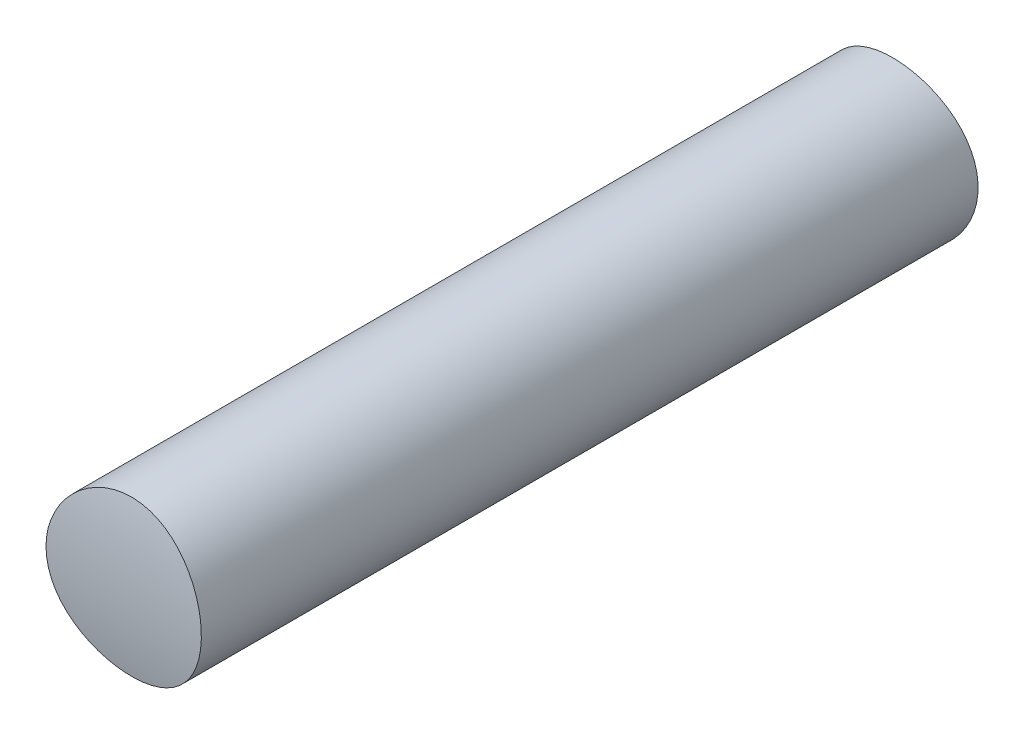
ISO-10303-21;
HEADER;
FILE_DESCRIPTION(('STEP AP214'),'2;1');
FILE_NAME('part.step','',(''),(''),'','','');
FILE_SCHEMA(('AUTOMOTIVE_DESIGN { 1 0 10303 214 1 1 1 1 }'));
ENDSEC;
DATA;
#1=APPLICATION_CONTEXT('core data for automotive mechanical design processes');
#2=APPLICATION_PROTOCOL_DEFINITION('international standard','automotive_design',2000,#1);
#3=PRODUCT_CONTEXT('',#1,'mechanical');
#4=PRODUCT('Part','Part','',(#3));
#5=PRODUCT_RELATED_PRODUCT_CATEGORY('part','',(#4));
#6=PRODUCT_DEFINITION_FORMATION('','',#4);
#7=PRODUCT_DEFINITION_CONTEXT('part definition',#1,'design');
#8=PRODUCT_DEFINITION('design','',#6,#7);
#9=PRODUCT_DEFINITION_SHAPE('','',#8);
#10=(LENGTH_UNIT() NAMED_UNIT(*) SI_UNIT(.MILLI.,.METRE.));
#11=(NAMED_UNIT(*) PLANE_ANGLE_UNIT() SI_UNIT($,.RADIAN.));
#12=(NAMED_UNIT(*) SI_UNIT($,.STERADIAN.) SOLID_ANGLE_UNIT());
#13=UNCERTAINTY_MEASURE_WITH_UNIT(LENGTH_MEASURE(1.E-05),#10,'distance_accuracy_value','');
#14=(GEOMETRIC_REPRESENTATION_CONTEXT(3) GLOBAL_UNCERTAINTY_ASSIGNED_CONTEXT((#13)) GLOBAL_UNIT_ASSIGNED_CONTEXT((#10,
#11,#12)) REPRESENTATION_CONTEXT('',''));
#15=CARTESIAN_POINT('',(0.,0.,0.));
#16=DIRECTION('',(0.,0.,1.));
#17=DIRECTION('',(1.,0.,0.));
#18=AXIS2_PLACEMENT_3D('',#15,#16,#17);
#19=CARTESIAN_POINT('',(0.,0.,37.5));
#20=DIRECTION('',(0.,0.,-1.));
#21=DIRECTION('',(-1.,0.,0.));
#22=AXIS2_PLACEMENT_3D('',#19,#20,#21);
#23=CYLINDRICAL_SURFACE('',#22,7.5);
#24=CARTESIAN_POINT('',(-7.5,0.,-37.5));
#25=CARTESIAN_POINT('',(-7.49999902971956,0.208285250918019,-37.4999995169678));
#26=CARTESIAN_POINT('',(-7.49131612405443,0.416595944699032,-37.4982602523473));
#27=CARTESIAN_POINT('',(-7.45664426063963,0.831795161758265,-37.4913491590143));
#28=CARTESIAN_POINT('',(-7.43064748066552,1.0386829995019,-37.4861757788082));
#29=CARTESIAN_POINT('',(-7.36149503695667,1.44979441328923,-37.4725293883136));
#30=CARTESIAN_POINT('',(-7.31831272239691,1.6540133400208,-37.4640512535298));
#31=CARTESIAN_POINT('',(-7.21511011170672,2.05807781361966,-37.4440282791705));
#32=CARTESIAN_POINT('',(-7.15508340534659,2.2579216642539,-37.4324822721878));
#33=CARTESIAN_POINT('',(-7.0187851239922,2.65140120687642,-37.4066689059164));
#34=CARTESIAN_POINT('',(-6.94254308411286,2.84504745934689,-37.3924064992328));
#35=CARTESIAN_POINT('',(-6.77428825915883,3.2252521960877,-37.3615329427972));
#36=CARTESIAN_POINT('',(-6.68226964591508,3.41180802979487,-37.3449209254522));
#37=CARTESIAN_POINT('',(-6.48322039652258,3.77636781419721,-37.3098185627179));
#38=CARTESIAN_POINT('',(-6.37620063391718,3.95437783493624,-37.2913295804949));
#39=CARTESIAN_POINT('',(-6.14780818386624,4.30087522835744,-37.2529579060111));
#40=CARTESIAN_POINT('',(-6.02643006447892,4.46935896127352,-37.2330746874594));
#41=CARTESIAN_POINT('',(-5.76866577078873,4.79755639657858,-37.192218618291));
#42=CARTESIAN_POINT('',(-5.6321189892616,4.9571427192329,-37.1712356574786));
#43=CARTESIAN_POINT('',(-5.34608468592072,5.26435639175619,-37.1289726594288));
#44=CARTESIAN_POINT('',(-5.19659129850026,5.41197826174014,-37.1076924912389));
#45=CARTESIAN_POINT('',(-4.8857061435719,5.69420372354363,-37.0654341911967));
#46=CARTESIAN_POINT('',(-4.72431279562634,5.828805580663,-37.0444560999071));
#47=CARTESIAN_POINT('',(-4.39080564665395,6.08398652665161,-37.0034026416353));
#48=CARTESIAN_POINT('',(-4.21869672948238,6.2045719330121,-36.9833268704816));
#49=CARTESIAN_POINT('',(-3.86316251866858,6.43202393251202,-36.9444517127192));
#50=CARTESIAN_POINT('',(-3.67964504016922,6.53874889172942,-36.9256663073429));
#51=CARTESIAN_POINT('',(-3.30413988201603,6.7362934120683,-36.8901399392458));
#52=CARTESIAN_POINT('',(-3.11215548629846,6.82711907306035,-36.8733981932111));
#53=CARTESIAN_POINT('',(-2.72094072838064,6.99225097605654,-36.8424414322892));
#54=CARTESIAN_POINT('',(-2.5217081902631,7.06655220895189,-36.8282271838324));
#55=CARTESIAN_POINT('',(-2.11756010982976,7.19799088390685,-36.8027636444553));
#56=CARTESIAN_POINT('',(-1.91264686283292,7.25513515101934,-36.7915131747607));
#57=CARTESIAN_POINT('',(-1.50119692955397,7.35122229614338,-36.7724339900126));
#58=CARTESIAN_POINT('',(-1.2947141202986,7.39038762689044,-36.7645635374252));
#59=CARTESIAN_POINT('',(-0.879165267599078,7.45125138010214,-36.7522763809965));
#60=CARTESIAN_POINT('',(-0.670100218718799,7.47295632686055,-36.7478583871179));
#61=CARTESIAN_POINT('',(-0.250821212441949,7.49874710722053,-36.74260423411));
#62=CARTESIAN_POINT('',(-0.0406071479912055,7.50283127007261,-36.7417684146316));
#63=CARTESIAN_POINT('',(0.379404347814056,7.4933421237438,-36.7437048678115));
#64=CARTESIAN_POINT('',(0.589201782647613,7.47976896263553,-36.746477110213));
#65=CARTESIAN_POINT('',(1.0036463337713,7.43541944129836,-36.7554762999837));
#66=CARTESIAN_POINT('',(1.20832315749137,7.4049092024866,-36.7616497946248));
#67=CARTESIAN_POINT('',(1.61440860579773,7.32710306324073,-36.7772366166266));
#68=CARTESIAN_POINT('',(1.81581607215807,7.27980134423553,-36.7866510670066));
#69=CARTESIAN_POINT('',(2.21382326765599,7.16879743887004,-36.8084438338772));
#70=CARTESIAN_POINT('',(2.41042451393873,7.1051005030216,-36.8208212014152));
#71=CARTESIAN_POINT('',(2.79761460561681,6.96175161590562,-36.8481931225643));
#72=CARTESIAN_POINT('',(2.98820118172495,6.88209372406487,-36.863188650371));
#73=CARTESIAN_POINT('',(3.36320817291061,6.70685770605166,-36.8954745648375));
#74=CARTESIAN_POINT('',(3.54758110214772,6.61118057945138,-36.912779077117));
#75=CARTESIAN_POINT('',(3.90769411401562,6.40491989100834,-36.9491267238105));
#76=CARTESIAN_POINT('',(4.08343118598493,6.29433118024173,-36.9681704580363));
#77=CARTESIAN_POINT('',(4.42502016164686,6.05905927201757,-37.0074589379098));
#78=CARTESIAN_POINT('',(4.5908735312183,5.9343781726258,-37.0277035045657));
#79=CARTESIAN_POINT('',(4.91163849412743,5.67175232845816,-37.0688398344937));
#80=CARTESIAN_POINT('',(5.0665499554376,5.53380742368564,-37.0897316055708));
#81=CARTESIAN_POINT('',(5.36709828642525,5.24297308993082,-37.131970129163));
#82=CARTESIAN_POINT('',(5.51251793361918,5.08985929419431,-37.1533183006386));
#83=CARTESIAN_POINT('',(5.78991839269497,4.77193228210156,-37.195488461239));
#84=CARTESIAN_POINT('',(5.92190373024777,4.60712303760459,-37.2163106257729));
#85=CARTESIAN_POINT('',(6.17167270163691,4.26673796614689,-37.2568697205683));
#86=CARTESIAN_POINT('',(6.28944475511812,4.09115353339292,-37.2766057588753));
#87=CARTESIAN_POINT('',(6.50977653322547,3.73060678119788,-37.3144129068572));
#88=CARTESIAN_POINT('',(6.61234204003817,3.54564806234884,-37.3324846483743));
#89=CARTESIAN_POINT('',(6.80181869301121,3.16704827835546,-37.3665093748376));
#90=CARTESIAN_POINT('',(6.88868601790013,2.97338473733911,-37.3824563970653));
#91=CARTESIAN_POINT('',(7.04572306438673,2.57929421395421,-37.4117128708408));
#92=CARTESIAN_POINT('',(7.11589930759353,2.37886990824627,-37.4250233522079));
#93=CARTESIAN_POINT('',(7.23894265517568,1.97297020126236,-37.4486134500925));
#94=CARTESIAN_POINT('',(7.29183836230164,1.76750375817339,-37.4588980721788));
#95=CARTESIAN_POINT('',(7.38003422880102,1.35277742961405,-37.476166119013));
#96=CARTESIAN_POINT('',(7.41534275783687,1.14351939777807,-37.4831511139574));
#97=CARTESIAN_POINT('',(7.46112304973197,0.778434766567267,-37.4922393572955));
#98=CARTESIAN_POINT('',(7.47569545520945,0.623129384709211,-37.4951454468941));
#99=CARTESIAN_POINT('',(7.49513430028926,0.311887423629806,-37.4990259504125));
#100=CARTESIAN_POINT('',(7.50000072648473,0.155950843536883,-37.500000361664));
#101=CARTESIAN_POINT('',(7.49999902971958,-0.208285250918016,-37.4999995169678));
#102=CARTESIAN_POINT('',(7.49131612405443,-0.416595944699027,-37.4982602523473));
#103=CARTESIAN_POINT('',(7.45664426063963,-0.83179516175826,-37.4913491590143));
#104=CARTESIAN_POINT('',(7.43064748066552,-1.03868299950189,-37.4861757788082));
#105=CARTESIAN_POINT('',(7.36149503695667,-1.44979441328922,-37.4725293883136));
#106=CARTESIAN_POINT('',(7.31831272239692,-1.6540133400208,-37.4640512535298));
#107=CARTESIAN_POINT('',(7.21511011170672,-2.05807781361966,-37.4440282791705));
#108=CARTESIAN_POINT('',(7.15508340534659,-2.2579216642539,-37.4324822721878));
#109=CARTESIAN_POINT('',(7.0187851239922,-2.65140120687642,-37.4066689059164));
#110=CARTESIAN_POINT('',(6.94254308411286,-2.84504745934689,-37.3924064992328));
#111=CARTESIAN_POINT('',(6.77428825915883,-3.2252521960877,-37.3615329427972));
#112=CARTESIAN_POINT('',(6.68226964591508,-3.41180802979488,-37.3449209254522));
#113=CARTESIAN_POINT('',(6.48322039652258,-3.77636781419721,-37.3098185627179));
#114=CARTESIAN_POINT('',(6.37620063391718,-3.95437783493624,-37.2913295804949));
#115=CARTESIAN_POINT('',(6.14780818386623,-4.30087522835744,-37.2529579060111));
#116=CARTESIAN_POINT('',(6.02643006447892,-4.46935896127353,-37.2330746874594));
#117=CARTESIAN_POINT('',(5.76866577078873,-4.79755639657858,-37.192218618291));
#118=CARTESIAN_POINT('',(5.6321189892616,-4.9571427192329,-37.1712356574786));
#119=CARTESIAN_POINT('',(5.34608468592072,-5.26435639175619,-37.1289726594288));
#120=CARTESIAN_POINT('',(5.19659129850026,-5.41197826174014,-37.1076924912389));
#121=CARTESIAN_POINT('',(4.8857061435719,-5.69420372354363,-37.0654341911967));
#122=CARTESIAN_POINT('',(4.72431279562634,-5.82880558066301,-37.0444560999071));
#123=CARTESIAN_POINT('',(4.39080564665395,-6.08398652665161,-37.0034026416353));
#124=CARTESIAN_POINT('',(4.21869672948238,-6.2045719330121,-36.9833268704816));
#125=CARTESIAN_POINT('',(3.86316251866858,-6.43202393251202,-36.9444517127192));
#126=CARTESIAN_POINT('',(3.67964504016922,-6.53874889172942,-36.9256663073429));
#127=CARTESIAN_POINT('',(3.30413988201603,-6.7362934120683,-36.8901399392458));
#128=CARTESIAN_POINT('',(3.11215548629846,-6.82711907306035,-36.8733981932111));
#129=CARTESIAN_POINT('',(2.72094072838064,-6.99225097605654,-36.8424414322892));
#130=CARTESIAN_POINT('',(2.5217081902631,-7.06655220895189,-36.8282271838324));
#131=CARTESIAN_POINT('',(2.11756010982976,-7.19799088390685,-36.8027636444553));
#132=CARTESIAN_POINT('',(1.91264686283292,-7.25513515101934,-36.7915131747607));
#133=CARTESIAN_POINT('',(1.50119692955397,-7.35122229614337,-36.7724339900126));
#134=CARTESIAN_POINT('',(1.2947141202986,-7.39038762689044,-36.7645635374252));
#135=CARTESIAN_POINT('',(0.87916526759908,-7.45125138010214,-36.7522763809965));
#136=CARTESIAN_POINT('',(0.6701002187188,-7.47295632686055,-36.7478583871179));
#137=CARTESIAN_POINT('',(0.250821212441949,-7.49874710722053,-36.74260423411));
#138=CARTESIAN_POINT('',(0.0406071479912055,-7.50283127007261,-36.7417684146316));
#139=CARTESIAN_POINT('',(-0.379404347814056,-7.4933421237438,-36.7437048678115));
#140=CARTESIAN_POINT('',(-0.589201782647614,-7.47976896263553,-36.746477110213));
#141=CARTESIAN_POINT('',(-1.0036463337713,-7.43541944129836,-36.7554762999837));
#142=CARTESIAN_POINT('',(-1.20832315749137,-7.4049092024866,-36.7616497946248));
#143=CARTESIAN_POINT('',(-1.61440860579773,-7.32710306324073,-36.7772366166266));
#144=CARTESIAN_POINT('',(-1.81581607215807,-7.27980134423553,-36.7866510670066));
#145=CARTESIAN_POINT('',(-2.21382326765599,-7.16879743887004,-36.8084438338772));
#146=CARTESIAN_POINT('',(-2.41042451393873,-7.1051005030216,-36.8208212014152));
#147=CARTESIAN_POINT('',(-2.79761460561681,-6.96175161590562,-36.8481931225643));
#148=CARTESIAN_POINT('',(-2.98820118172495,-6.88209372406487,-36.863188650371));
#149=CARTESIAN_POINT('',(-3.36320817291061,-6.70685770605166,-36.8954745648375));
#150=CARTESIAN_POINT('',(-3.54758110214772,-6.61118057945138,-36.912779077117));
#151=CARTESIAN_POINT('',(-3.90769411401562,-6.40491989100834,-36.9491267238105));
#152=CARTESIAN_POINT('',(-4.08343118598492,-6.29433118024173,-36.9681704580363));
#153=CARTESIAN_POINT('',(-4.42502016164686,-6.05905927201757,-37.0074589379098));
#154=CARTESIAN_POINT('',(-4.5908735312183,-5.9343781726258,-37.0277035045657));
#155=CARTESIAN_POINT('',(-4.91163849412743,-5.67175232845816,-37.0688398344937));
#156=CARTESIAN_POINT('',(-5.0665499554376,-5.53380742368564,-37.0897316055708));
#157=CARTESIAN_POINT('',(-5.36709828642525,-5.24297308993082,-37.131970129163));
#158=CARTESIAN_POINT('',(-5.51251793361918,-5.08985929419431,-37.1533183006386));
#159=CARTESIAN_POINT('',(-5.78991839269497,-4.77193228210156,-37.195488461239));
#160=CARTESIAN_POINT('',(-5.92190373024777,-4.60712303760459,-37.2163106257729));
#161=CARTESIAN_POINT('',(-6.17167270163691,-4.26673796614689,-37.2568697205683));
#162=CARTESIAN_POINT('',(-6.28944475511812,-4.09115353339291,-37.2766057588753));
#163=CARTESIAN_POINT('',(-6.50977653322548,-3.73060678119788,-37.3144129068572));
#164=CARTESIAN_POINT('',(-6.61234204003817,-3.54564806234884,-37.3324846483743));
#165=CARTESIAN_POINT('',(-6.80181869301121,-3.16704827835546,-37.3665093748376));
#166=CARTESIAN_POINT('',(-6.88868601790013,-2.97338473733911,-37.3824563970653));
#167=CARTESIAN_POINT('',(-7.04572306438673,-2.57929421395421,-37.4117128708408));
#168=CARTESIAN_POINT('',(-7.11589930759353,-2.37886990824627,-37.4250233522079));
#169=CARTESIAN_POINT('',(-7.23894265517568,-1.97297020126237,-37.4486134500925));
#170=CARTESIAN_POINT('',(-7.29183836230164,-1.76750375817339,-37.4588980721788));
#171=CARTESIAN_POINT('',(-7.38003422880102,-1.35277742961405,-37.476166119013));
#172=CARTESIAN_POINT('',(-7.41534275783686,-1.14351939777807,-37.4831511139574));
#173=CARTESIAN_POINT('',(-7.46112304973197,-0.778434766567266,-37.4922393572955));
#174=CARTESIAN_POINT('',(-7.47569545520946,-0.623129384709209,-37.4951454468941));
#175=CARTESIAN_POINT('',(-7.49513430028926,-0.311887423629804,-37.4990259504125));
#176=CARTESIAN_POINT('',(-7.50000072648472,-0.155950843536881,-37.500000361664));
#177=CARTESIAN_POINT('',(-7.5,0.,-37.5));
#178=B_SPLINE_CURVE_WITH_KNOTS('',3,(#24,#25,#26,#27,#28,#29,#30,#31,#32,#33,#34,#35,#36,#37,
#38,#39,#40,#41,#42,#43,#44,#45,#46,#47,#48,#49,#50,#51,#52,#53,#54,#55,#56,#57,#58,#59,#60,#61,
#62,#63,#64,#65,#66,#67,#68,#69,#70,#71,#72,#73,#74,#75,#76,#77,#78,#79,#80,#81,#82,#83,#84,#85,
#86,#87,#88,#89,#90,#91,#92,#93,#94,#95,#96,#97,#98,#99,#100,#101,#102,#103,#104,#105,#106,#107,
#108,#109,#110,#111,#112,#113,#114,#115,#116,#117,#118,#119,#120,#121,#122,#123,#124,#125,#126,
#127,#128,#129,#130,#131,#132,#133,#134,#135,#136,#137,#138,#139,#140,#141,#142,#143,#144,#145,
#146,#147,#148,#149,#150,#151,#152,#153,#154,#155,#156,#157,#158,#159,#160,#161,#162,#163,#164,
#165,#166,#167,#168,#169,#170,#171,#172,#173,#174,#175,#176,#177),.UNSPECIFIED.,.T.,.F.,(4,2,2,
2,2,2,2,2,2,2,2,2,2,2,2,2,2,2,2,2,2,2,2,2,2,2,2,2,2,2,2,2,2,2,2,2,2,2,2,2,2,2,2,2,2,2,2,2,2,2,2,
2,2,2,2,2,2,2,2,2,2,2,2,2,2,2,2,2,2,2,2,2,2,2,2,2,4),(0.,0.624712197528687,1.24970682502355,
1.8756744764054,2.50188066717014,3.12695588782765,3.75226252278795,4.37711822744394,
5.00221108322053,5.63470129433434,6.26747957662201,6.90034205030294,7.53291816513303,
8.17152043794301,8.80987716724068,9.44842714092995,10.0867227614111,10.7168925185891,
11.3468266953313,11.9768205992162,12.606809220067,13.227168486148,13.8477429288317,
14.4681188814138,15.0887261645959,15.7133209016402,16.3381318642615,16.9628499276509,
17.587575527741,18.2235499120322,18.8593093389876,19.4955833067907,20.1316147117834,
20.7693950512931,21.4069257837235,22.0433958646003,22.6795627620186,23.1473071614475,
23.6150522069703,24.239764404499,24.8647590319938,25.4907266833757,26.1169328741404,
26.7420080947979,27.3673147297582,27.9921704344142,28.6172632901908,29.2497535013046,
29.8825317835923,30.5153942572732,31.1479703721033,31.7865726449133,32.424929374211,
33.0634793479002,33.7017749683814,34.3319447255593,34.9618789023016,35.5918728061865,
36.2218614270373,36.8422206931183,37.462795135802,38.0831710883841,38.7037783715662,
39.3283731086104,39.9531840712318,40.5779021346212,41.2026277347112,41.8386021190025,
42.4743615459578,43.1106355137609,43.7466669187537,44.3844472582634,45.0219779906937,
45.6584480715706,46.2946149689889,46.7623593684178,47.2301044139406),.UNSPECIFIED.);
#179=CARTESIAN_POINT('',(-7.5,0.,-37.5));
#180=VERTEX_POINT('',#179);
#181=EDGE_CURVE('E41',#180,#180,#178,.T.);
#182=ORIENTED_EDGE('',*,*,#181,.F.);
#183=EDGE_LOOP('',(#182));
#184=FACE_BOUND('',#183,.T.);
#185=CARTESIAN_POINT('',(-7.5,0.,37.5));
#186=CARTESIAN_POINT('',(-7.50000415406846,-0.208483315310918,37.5000021097477));
#187=CARTESIAN_POINT('',(-7.49130470044979,-0.41691460283817,37.4982583792321));
#188=CARTESIAN_POINT('',(-7.4565840093247,-0.832334416575861,37.4913367448348));
#189=CARTESIAN_POINT('',(-7.43055984843312,-1.03932269333409,37.4861582613707));
#190=CARTESIAN_POINT('',(-7.36137215586304,-1.45040572618121,37.4725053637865));
#191=CARTESIAN_POINT('',(-7.31819976645866,-1.65449893033555,37.4640292463569));
#192=CARTESIAN_POINT('',(-7.21503802103792,-2.05831663415844,37.4440143844082));
#193=CARTESIAN_POINT('',(-7.15504248405728,-2.25803949899806,37.4324745143239));
#194=CARTESIAN_POINT('',(-7.01879438710297,-2.65137476573173,37.4066706680657));
#195=CARTESIAN_POINT('',(-6.94256376440252,-2.84499501234896,37.3924103704889));
#196=CARTESIAN_POINT('',(-6.77433604938429,-3.22514992041127,37.3615416354369));
#197=CARTESIAN_POINT('',(-6.68233313914487,-3.41168193609257,37.3449323318815));
#198=CARTESIAN_POINT('',(-6.48329211776848,-3.77624624960627,37.3098310017852));
#199=CARTESIAN_POINT('',(-6.37626078318279,-3.95428233017419,37.2913398248392));
#200=CARTESIAN_POINT('',(-6.1478411800004,-4.30082942089902,37.2529633108609));
#201=CARTESIAN_POINT('',(-6.0264474766386,-4.46933678948473,37.2330774472415));
#202=CARTESIAN_POINT('',(-5.7686623125843,-4.7975608015667,37.1922180702349));
#203=CARTESIAN_POINT('',(-5.63211170999935,-4.95715122717416,37.1712345389031));
#204=CARTESIAN_POINT('',(-5.34606910527543,-5.26437243600153,37.1289704003494));
#205=CARTESIAN_POINT('',(-5.1965712379913,-5.41199773974933,37.107689662192));
#206=CARTESIAN_POINT('',(-4.88568482306476,-5.69422181145278,37.0654313950635));
#207=CARTESIAN_POINT('',(-4.72429532675039,-5.82881953812857,37.0444538904434));
#208=CARTESIAN_POINT('',(-4.39079648375255,-6.08399294654521,37.003401572794));
#209=CARTESIAN_POINT('',(-4.21869202069831,-6.20457494551161,36.9833263556041));
#210=CARTESIAN_POINT('',(-3.86316327859793,-6.43202344628043,36.9444517958174));
#211=CARTESIAN_POINT('',(-3.67964660010331,-6.53874798452959,36.9256664669901));
#212=CARTESIAN_POINT('',(-3.30414310550971,-6.73629180278303,36.8901402321636));
#213=CARTESIAN_POINT('',(-3.11215957311373,-6.82711718222068,36.8733985429072));
#214=CARTESIAN_POINT('',(-2.72094493411017,-6.99224936665368,36.8424417389775));
#215=CARTESIAN_POINT('',(-2.52171159076531,-7.06655102254029,36.8282274121546));
#216=CARTESIAN_POINT('',(-2.11756184589631,-7.19799039974723,36.8027637397732));
#217=CARTESIAN_POINT('',(-1.91264773972819,-7.25513494622282,36.7915132154231));
#218=CARTESIAN_POINT('',(-1.50119677217586,-7.35122233290873,36.7724339827146));
#219=CARTESIAN_POINT('',(-1.29471380265331,-7.39038768714153,36.7645635253232));
#220=CARTESIAN_POINT('',(-0.879164627113547,-7.45125146019002,36.7522763647667));
#221=CARTESIAN_POINT('',(-0.670099415671663,-7.47295640337694,36.747858371549));
#222=CARTESIAN_POINT('',(-0.250820406690045,-7.49874712966212,36.7426042295188));
#223=CARTESIAN_POINT('',(-0.040606503827776,-7.50283126903194,36.7417684148642));
#224=CARTESIAN_POINT('',(0.379404668906108,-7.49334210297715,36.7437048720291));
#225=CARTESIAN_POINT('',(0.589201942255277,-7.47976894556144,36.7464771136048));
#226=CARTESIAN_POINT('',(1.00364711210596,-7.43541935800376,36.7554763169571));
#227=CARTESIAN_POINT('',(1.20832470734035,-7.40490897147401,36.7616498416296));
#228=CARTESIAN_POINT('',(1.61441167976592,-7.32710240830468,36.7772367471033));
#229=CARTESIAN_POINT('',(1.81581989853831,-7.27980041213413,36.7866512511086));
#230=CARTESIAN_POINT('',(2.2138269122664,-7.16879628734338,36.808444057063));
#231=CARTESIAN_POINT('',(2.41042726338708,-7.10509954425792,36.8208213856562));
#232=CARTESIAN_POINT('',(2.79761584046053,-6.96175109954607,36.8481932199925));
#233=CARTESIAN_POINT('',(2.98820179013212,-6.88209343903769,36.8631887029329));
#234=CARTESIAN_POINT('',(3.36319921077539,-6.70686189467481,36.8954737930672));
#235=CARTESIAN_POINT('',(3.54756352736487,-6.61118970163632,36.9127774272521));
#236=CARTESIAN_POINT('',(3.90766409763828,-6.40493802768173,36.9491235700507));
#237=CARTESIAN_POINT('',(4.0833971533219,-6.29435307738543,36.9681667158144));
#238=CARTESIAN_POINT('',(4.42495856685814,-6.05910323823583,37.007451680742));
#239=CARTESIAN_POINT('',(4.59078954975946,-5.93444210655371,37.0276931793623));
#240=CARTESIAN_POINT('',(4.91157109943957,-5.67181233229327,37.0688307465389));
#241=CARTESIAN_POINT('',(5.06651758308154,-5.53383874135229,37.0897270565307));
#242=CARTESIAN_POINT('',(5.36707826434377,-5.24299247341352,37.1319673147738));
#243=CARTESIAN_POINT('',(5.51247947298022,-5.08989980615945,37.1533126540753));
#244=CARTESIAN_POINT('',(5.78994262793909,-4.77190807366215,37.1954919452116));
#245=CARTESIAN_POINT('',(5.92199985587514,-4.60700486722731,37.2163257141993));
#246=CARTESIAN_POINT('',(6.17177665724625,-4.26658345159894,37.2568871237155));
#247=CARTESIAN_POINT('',(6.28949833892692,-4.09106680895753,37.2766149266612));
#248=CARTESIAN_POINT('',(6.50978227866336,-3.73059642031793,37.3144139195139));
#249=CARTESIAN_POINT('',(6.61234470988114,-3.54564278214968,37.332485128343));
#250=CARTESIAN_POINT('',(6.80172211840374,-3.16724119278212,37.3664920321893));
#251=CARTESIAN_POINT('',(6.88850910684399,-2.97377888610105,37.3824239187797));
#252=CARTESIAN_POINT('',(7.04542346872728,-2.58009570605891,37.4116565757603));
#253=CARTESIAN_POINT('',(7.11555662288271,-2.37987720548218,37.4249582588515));
#254=CARTESIAN_POINT('',(7.23865573273428,-1.9740391522938,37.4485578358328));
#255=CARTESIAN_POINT('',(7.29162038260822,-1.76841919013666,37.458855501234));
#256=CARTESIAN_POINT('',(7.37994707683015,-1.35329640920947,37.4761489474015));
#257=CARTESIAN_POINT('',(7.41530937121296,-1.143793645637,37.4831447750692));
#258=CARTESIAN_POINT('',(7.46769432554848,-0.726022872298725,37.4935435942351));
#259=CARTESIAN_POINT('',(7.48501703979332,-0.517793904389697,37.4970053485391));
#260=CARTESIAN_POINT('',(7.50223405346,-0.100514006223324,37.5004459103632));
#261=CARTESIAN_POINT('',(7.50212229346546,0.108537184557892,37.5004235069515));
#262=CARTESIAN_POINT('',(7.48445807855669,0.525819777437648,37.4968937200496));
#263=CARTESIAN_POINT('',(7.46690988949873,0.734051367543202,37.493387188958));
#264=CARTESIAN_POINT('',(7.41451997179765,1.14824650562539,37.4829887885253));
#265=CARTESIAN_POINT('',(7.37967783857597,1.35421000042644,37.4760968399849));
#266=CARTESIAN_POINT('',(7.29336932485347,1.76054367551311,37.4591973333901));
#267=CARTESIAN_POINT('',(7.24205586241375,1.96094756464056,37.4492184637627));
#268=CARTESIAN_POINT('',(7.12311271317182,2.35668278023705,37.4263988505881));
#269=CARTESIAN_POINT('',(7.05548315559324,2.55201414686695,37.4135581297068));
#270=CARTESIAN_POINT('',(6.90440792878432,2.93628621963515,37.3853627122177));
#271=CARTESIAN_POINT('',(6.82096124398325,3.12522651450326,37.3700078541931));
#272=CARTESIAN_POINT('',(6.63886096332044,3.49543705856643,37.3371993875037));
#273=CARTESIAN_POINT('',(6.54020741795749,3.67670733322947,37.3197457858083));
#274=CARTESIAN_POINT('',(6.32706970789877,4.03258484683883,37.2829808336499));
#275=CARTESIAN_POINT('',(6.21240405193511,4.20708129122912,37.2636490923871));
#276=CARTESIAN_POINT('',(5.96904288951177,4.54576684050287,37.2238508628629));
#277=CARTESIAN_POINT('',(5.8403522674888,4.70995950266232,37.2033847708714));
#278=CARTESIAN_POINT('',(5.56972552811313,5.02708957326882,37.1618616507606));
#279=CARTESIAN_POINT('',(5.42778342171903,5.1800218361536,37.1408043584827));
#280=CARTESIAN_POINT('',(5.13170963552587,5.47348023494801,37.0986924987934));
#281=CARTESIAN_POINT('',(4.97758232661547,5.61401078147505,37.0776379330941));
#282=CARTESIAN_POINT('',(4.65561631740762,5.88388008800991,37.0357786000378));
#283=CARTESIAN_POINT('',(4.48760097057214,6.0130096061901,37.0149828796051));
#284=CARTESIAN_POINT('',(4.14121601563338,6.2566080498131,36.9745872135942));
#285=CARTESIAN_POINT('',(3.96285024288188,6.37108235596721,36.9549868305356));
#286=CARTESIAN_POINT('',(3.59686678965576,6.58463755429622,36.9175339181867));
#287=CARTESIAN_POINT('',(3.40924584326965,6.68371296066232,36.8996820126197));
#288=CARTESIAN_POINT('',(3.02619151962431,6.86564665357399,36.8662644264114));
#289=CARTESIAN_POINT('',(2.83076123028599,6.94851127514729,36.8506978532788));
#290=CARTESIAN_POINT('',(2.43437144559592,7.09707091203924,36.822374711348));
#291=CARTESIAN_POINT('',(2.23344350624725,7.16284756433133,36.8096048292481));
#292=CARTESIAN_POINT('',(1.82666509150451,7.27721885454303,36.7871646774489));
#293=CARTESIAN_POINT('',(1.62081648291062,7.32581990145493,36.777493251702));
#294=CARTESIAN_POINT('',(1.20560630510901,7.40548466479412,36.7615349291007));
#295=CARTESIAN_POINT('',(0.996244469122745,7.43654704315243,36.7552482904819));
#296=CARTESIAN_POINT('',(0.575569560083804,7.48087232675321,36.7462523700107));
#297=CARTESIAN_POINT('',(0.364256514751329,7.49413548447293,36.7435430374152));
#298=CARTESIAN_POINT('',(-0.0548676279124329,7.50267395939909,36.7418004440825));
#299=CARTESIAN_POINT('',(-0.262671892806006,7.49827463763881,36.7427006907782));
#300=CARTESIAN_POINT('',(-0.677227020143757,7.47224940255876,36.7480021903901));
#301=CARTESIAN_POINT('',(-0.883977491485999,7.45061750423539,36.7524046596538));
#302=CARTESIAN_POINT('',(-1.2947943254336,7.39030407682712,36.764580089633));
#303=CARTESIAN_POINT('',(-1.4988616708182,7.35162898025212,36.7723517787065));
#304=CARTESIAN_POINT('',(-1.90302537971458,7.25751762390039,36.7910415327967));
#305=CARTESIAN_POINT('',(-2.10312024176781,7.20207515050235,36.8019607641531));
#306=CARTESIAN_POINT('',(-2.49734556104152,7.07502941214461,36.8265954172696));
#307=CARTESIAN_POINT('',(-2.69149039723702,7.00346929039375,36.8403033649738));
#308=CARTESIAN_POINT('',(-3.07305484128186,6.84463592993069,36.8701435324314));
#309=CARTESIAN_POINT('',(-3.26047421559238,6.75736214620025,36.8862758362687));
#310=CARTESIAN_POINT('',(-3.62733863002169,6.56772825515018,36.920512239071));
#311=CARTESIAN_POINT('',(-3.80678332182147,6.46536748970107,36.938616424045));
#312=CARTESIAN_POINT('',(-4.15651311230678,6.24627716794432,36.9762947245103));
#313=CARTESIAN_POINT('',(-4.3267980819474,6.12954740927814,36.9958688607013));
#314=CARTESIAN_POINT('',(-4.65991154810879,5.88040938896427,37.036292677648));
#315=CARTESIAN_POINT('',(-4.82256395862688,5.74776822725967,37.0571583909656));
#316=CARTESIAN_POINT('',(-5.13615606408507,5.46935687274789,37.0992715695963));
#317=CARTESIAN_POINT('',(-5.28709589118108,5.32358682811718,37.1205190305987));
#318=CARTESIAN_POINT('',(-5.57631086106478,5.01983590048018,37.1628142700838));
#319=CARTESIAN_POINT('',(-5.7145806404544,4.86184989799891,37.1838619606524));
#320=CARTESIAN_POINT('',(-5.97739026120306,4.53484188370158,37.2251575434954));
#321=CARTESIAN_POINT('',(-6.10193512055828,4.36582394152433,37.2454057263305));
#322=CARTESIAN_POINT('',(-6.33776091387043,4.01594005631662,37.2847629016773));
#323=CARTESIAN_POINT('',(-6.44888297278341,3.83496530621429,37.3038571206718));
#324=CARTESIAN_POINT('',(-6.65541661072577,3.46416700040671,37.3401156271458));
#325=CARTESIAN_POINT('',(-6.75083397632297,3.27434673715674,37.3572806247256));
#326=CARTESIAN_POINT('',(-6.92523675529546,2.88723498954161,37.389190267871));
#327=CARTESIAN_POINT('',(-7.00423210546083,2.68994810908542,37.4039363759352));
#328=CARTESIAN_POINT('',(-7.14523152105939,2.28927663717611,37.4305965678313));
#329=CARTESIAN_POINT('',(-7.20723885993585,2.08589322886263,37.442511197206));
#330=CARTESIAN_POINT('',(-7.33983469078939,1.57380323523498,37.46821309223));
#331=CARTESIAN_POINT('',(-7.39981471601755,1.26218624106522,37.4800712854718));
#332=CARTESIAN_POINT('',(-7.47989357918396,0.633672680464612,37.4959630118578));
#333=CARTESIAN_POINT('',(-7.49999368817422,0.316776282623468,37.4999967943813));
#334=CARTESIAN_POINT('',(-7.5,0.,37.5));
#335=B_SPLINE_CURVE_WITH_KNOTS('',3,(#185,#186,#187,#188,#189,#190,#191,#192,#193,#194,#195,
#196,#197,#198,#199,#200,#201,#202,#203,#204,#205,#206,#207,#208,#209,#210,#211,#212,#213,#214,
#215,#216,#217,#218,#219,#220,#221,#222,#223,#224,#225,#226,#227,#228,#229,#230,#231,#232,#233,
#234,#235,#236,#237,#238,#239,#240,#241,#242,#243,#244,#245,#246,#247,#248,#249,#250,#251,#252,
#253,#254,#255,#256,#257,#258,#259,#260,#261,#262,#263,#264,#265,#266,#267,#268,#269,#270,#271,
#272,#273,#274,#275,#276,#277,#278,#279,#280,#281,#282,#283,#284,#285,#286,#287,#288,#289,#290,
#291,#292,#293,#294,#295,#296,#297,#298,#299,#300,#301,#302,#303,#304,#305,#306,#307,#308,#309,
#310,#311,#312,#313,#314,#315,#316,#317,#318,#319,#320,#321,#322,#323,#324,#325,#326,#327,#328,
#329,#330,#331,#332,#333,#334),.UNSPECIFIED.,.T.,.F.,(4,2,2,2,2,2,2,2,2,2,2,2,2,2,2,2,2,2,2,2,2,
2,2,2,2,2,2,2,2,2,2,2,2,2,2,2,2,2,2,2,2,2,2,2,2,2,2,2,2,2,2,2,2,2,2,2,2,2,2,2,2,2,2,2,2,2,2,2,2,
2,2,2,2,2,4),(0.,0.625171788236199,1.25044909521505,1.87604980309508,2.50188066372338,
3.12687119053535,3.75209275553386,4.3770332983578,5.00221108155898,5.63471814112609,
6.2675132419863,6.90035887976465,7.53291816354519,8.17151772410143,8.80987175766558,
9.44842443669745,10.0867227597562,10.7168930013115,11.3468276598176,11.9768210794987,
12.6068092184148,13.2271708322685,13.84774765741,14.4681208879416,15.0887261629095,
15.7132911534557,16.3380858346729,16.9627141400789,17.58757552662,18.2234659200914,
18.8595803811642,19.4956011793063,20.1316147117104,20.7687458767553,21.4056555628661,
22.0426136804386,22.6795627500027,23.3057394185827,23.9321337176781,24.5583748059139,
25.1846305452698,25.8052326454105,26.4258298305379,27.0464668758717,27.6671018602448,
28.2954494412825,28.9235788845368,29.5519935995908,30.1801839132975,30.8181921574725,
31.4559654788076,32.093965486638,32.7317156696007,33.3663605438108,34.000768352752,
34.635224555717,35.2696717589928,35.8924859130345,36.5155164694753,37.1383120804368,
37.7613387691546,38.3827171721884,39.0041171314846,39.6255442057296,40.2469800325345,
40.8789855974446,41.5109840302459,42.1432487721929,42.7752815781831,43.414183802787,
44.05285008723,44.6911287892514,45.3292844138289,46.2792208967571,47.2291271028397),.UNSPECIFIED.);
#336=CARTESIAN_POINT('',(-7.5,0.,37.5));
#337=VERTEX_POINT('',#336);
#338=EDGE_CURVE('E11',#337,#337,#335,.T.);
#339=ORIENTED_EDGE('',*,*,#338,.F.);
#340=EDGE_LOOP('',(#339));
#341=FACE_BOUND('',#340,.T.);
#342=ADVANCED_FACE('F31',(#184,#341),#23,.T.);
#343=CARTESIAN_POINT('',(-7.5,0.,0.));
#344=DIRECTION('',(1.,0.,0.));
#345=DIRECTION('',(0.,0.,-1.));
#346=AXIS2_PLACEMENT_3D('',#343,#344,#345);
#347=CYLINDRICAL_SURFACE('',#346,37.5);
#348=ORIENTED_EDGE('',*,*,#181,.T.);
#349=EDGE_LOOP('',(#348));
#350=FACE_BOUND('',#349,.T.);
#351=ADVANCED_FACE('F53',(#350),#347,.T.);
#352=ORIENTED_EDGE('',*,*,#338,.T.);
#353=EDGE_LOOP('',(#352));
#354=FACE_BOUND('',#353,.T.);
#355=ADVANCED_FACE('F50',(#354),#347,.T.);
#356=CLOSED_SHELL('',(#342,#351,#355));
#357=MANIFOLD_SOLID_BREP('B2',#356);
#358=ADVANCED_BREP_SHAPE_REPRESENTATION('',(#18,#357),#14);
#359=SHAPE_DEFINITION_REPRESENTATION(#9,#358);
ENDSEC;
END-ISO-10303-21;
